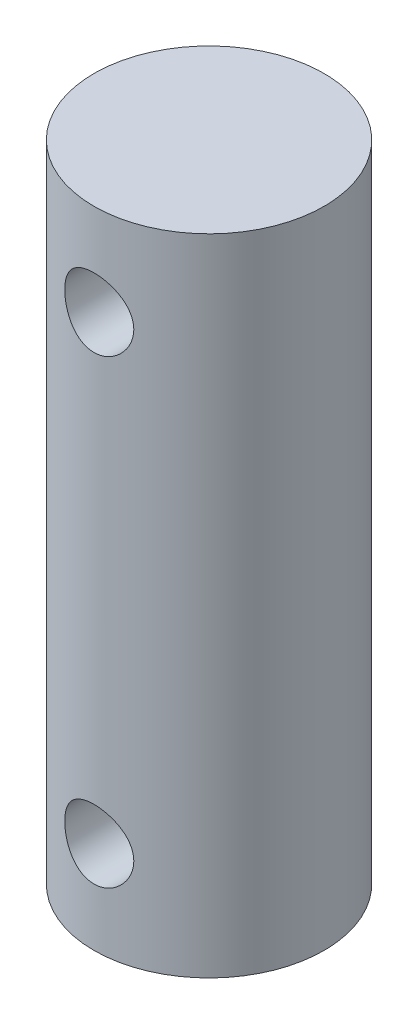
ISO-10303-21;
HEADER;
FILE_DESCRIPTION(('STEP AP214'),'2;1');
FILE_NAME('part.step','',(''),(''),'','','');
FILE_SCHEMA(('AUTOMOTIVE_DESIGN { 1 0 10303 214 1 1 1 1 }'));
ENDSEC;
DATA;
#1=APPLICATION_CONTEXT('core data for automotive mechanical design processes');
#2=APPLICATION_PROTOCOL_DEFINITION('international standard','automotive_design',2000,#1);
#3=PRODUCT_CONTEXT('',#1,'mechanical');
#4=PRODUCT('Part','Part','',(#3));
#5=PRODUCT_RELATED_PRODUCT_CATEGORY('part','',(#4));
#6=PRODUCT_DEFINITION_FORMATION('','',#4);
#7=PRODUCT_DEFINITION_CONTEXT('part definition',#1,'design');
#8=PRODUCT_DEFINITION('design','',#6,#7);
#9=PRODUCT_DEFINITION_SHAPE('','',#8);
#10=(LENGTH_UNIT() NAMED_UNIT(*) SI_UNIT(.MILLI.,.METRE.));
#11=(NAMED_UNIT(*) PLANE_ANGLE_UNIT() SI_UNIT($,.RADIAN.));
#12=(NAMED_UNIT(*) SI_UNIT($,.STERADIAN.) SOLID_ANGLE_UNIT());
#13=UNCERTAINTY_MEASURE_WITH_UNIT(LENGTH_MEASURE(1.E-05),#10,'distance_accuracy_value','');
#14=(GEOMETRIC_REPRESENTATION_CONTEXT(3) GLOBAL_UNCERTAINTY_ASSIGNED_CONTEXT((#13)) GLOBAL_UNIT_ASSIGNED_CONTEXT((#10,
#11,#12)) REPRESENTATION_CONTEXT('',''));
#15=CARTESIAN_POINT('',(0.,0.,0.));
#16=DIRECTION('',(0.,0.,1.));
#17=DIRECTION('',(1.,0.,0.));
#18=AXIS2_PLACEMENT_3D('',#15,#16,#17);
#19=CARTESIAN_POINT('',(0.,28.,0.));
#20=DIRECTION('',(0.,-1.,0.));
#21=DIRECTION('',(0.,0.,-1.));
#22=AXIS2_PLACEMENT_3D('',#19,#20,#21);
#23=CYLINDRICAL_SURFACE('',#22,4.9995);
#24=CARTESIAN_POINT('',(0.,5.5,-4.9995));
#25=CARTESIAN_POINT('',(-0.0822882318103573,5.49999900355128,-4.99949929315162));
#26=CARTESIAN_POINT('',(-0.164586545970862,5.49320619957434,-4.99744897138968));
#27=CARTESIAN_POINT('',(-0.326786557363017,5.4662789711516,-4.98947014707372));
#28=CARTESIAN_POINT('',(-0.40668753276012,5.4461405696831,-4.983540488474));
#29=CARTESIAN_POINT('',(-0.56172992899045,5.39325507558644,-4.96845270977354));
#30=CARTESIAN_POINT('',(-0.636878183004616,5.3605265872726,-4.95929935499205));
#31=CARTESIAN_POINT('',(-0.780620261284363,5.28346625714133,-4.9387155552233));
#32=CARTESIAN_POINT('',(-0.849213211567997,5.23913287104579,-4.92728480722892));
#33=CARTESIAN_POINT('',(-0.979867289964808,5.13877985499191,-4.90299843582714));
#34=CARTESIAN_POINT('',(-1.04171361277387,5.08248764616569,-4.89011360755218));
#35=CARTESIAN_POINT('',(-1.15524494911831,4.96039587422278,-4.86454548849677));
#36=CARTESIAN_POINT('',(-1.20692825236866,4.89459471411793,-4.85186223196738));
#37=CARTESIAN_POINT('',(-1.29979693147417,4.7535352145765,-4.82782429744026));
#38=CARTESIAN_POINT('',(-1.34072010192775,4.67809748284461,-4.81650590927061));
#39=CARTESIAN_POINT('',(-1.40921184417178,4.52101647920492,-4.79691571360438));
#40=CARTESIAN_POINT('',(-1.4367836236066,4.43937470326456,-4.78864317446338));
#41=CARTESIAN_POINT('',(-1.47701531781306,4.27461518498199,-4.77638567207312));
#42=CARTESIAN_POINT('',(-1.49007124433276,4.19160282020392,-4.77228711495926));
#43=CARTESIAN_POINT('',(-1.50213720984132,4.02447255669556,-4.76850370996817));
#44=CARTESIAN_POINT('',(-1.50115065277686,3.94035493082357,-4.76881779245157));
#45=CARTESIAN_POINT('',(-1.48547070443912,3.77662255107472,-4.77372350462486));
#46=CARTESIAN_POINT('',(-1.471273478402,3.69695487361318,-4.77816028593543));
#47=CARTESIAN_POINT('',(-1.43037684741301,3.54118858669451,-4.79056096619536));
#48=CARTESIAN_POINT('',(-1.40367620839198,3.46509033035001,-4.79852521329638));
#49=CARTESIAN_POINT('',(-1.33816524801101,3.31740949320808,-4.81720702437389));
#50=CARTESIAN_POINT('',(-1.29919401875796,3.24590306972879,-4.82796081770019));
#51=CARTESIAN_POINT('',(-1.2103599689013,3.11027857515019,-4.85099262684589));
#52=CARTESIAN_POINT('',(-1.16049450829025,3.04616230067435,-4.86327101180889));
#53=CARTESIAN_POINT('',(-1.04882339032887,2.92432403429443,-4.88859651842636));
#54=CARTESIAN_POINT('',(-0.986605995005051,2.86698099412054,-4.9016543277808));
#55=CARTESIAN_POINT('',(-0.853275435172072,2.76345442079052,-4.92661293163904));
#56=CARTESIAN_POINT('',(-0.782161710943637,2.71727159032387,-4.93851365325999));
#57=CARTESIAN_POINT('',(-0.632368302047808,2.63714621889189,-4.95992592037121));
#58=CARTESIAN_POINT('',(-0.5536411159832,2.60328776443068,-4.96942092348073));
#59=CARTESIAN_POINT('',(-0.391258759312093,2.54940399296898,-4.98483270164697));
#60=CARTESIAN_POINT('',(-0.307604970593451,2.52937481679157,-4.99075047490246));
#61=CARTESIAN_POINT('',(-0.140965580610644,2.50434909209977,-4.99818313348702));
#62=CARTESIAN_POINT('',(-0.0580637009655074,2.49883895173836,-4.99984837786376));
#63=CARTESIAN_POINT('',(0.107485605687788,2.50156816324412,-4.99902948297921));
#64=CARTESIAN_POINT('',(0.190133065194841,2.50980567924013,-4.99654589775536));
#65=CARTESIAN_POINT('',(0.350888890695829,2.5393811122736,-4.98780682505987));
#66=CARTESIAN_POINT('',(0.429057617811551,2.56041890987762,-4.98163780582543));
#67=CARTESIAN_POINT('',(0.580738763479281,2.61463661829694,-4.96624198187106));
#68=CARTESIAN_POINT('',(0.654250621044984,2.64781798872808,-4.95701480958421));
#69=CARTESIAN_POINT('',(0.796420887713407,2.72624300644525,-4.93619276376727));
#70=CARTESIAN_POINT('',(0.864927643717733,2.77174798416267,-4.92454804671716));
#71=CARTESIAN_POINT('',(0.99350758968355,2.87321093660342,-4.90022775161275));
#72=CARTESIAN_POINT('',(1.05357865861876,2.92917153202075,-4.88755191555985));
#73=CARTESIAN_POINT('',(1.16584348220005,3.05237012893718,-4.8620209445252));
#74=CARTESIAN_POINT('',(1.21767184545333,3.11994393236998,-4.84917602136773));
#75=CARTESIAN_POINT('',(1.30927911246089,3.26310867937917,-4.82525005243495));
#76=CARTESIAN_POINT('',(1.34905833192434,3.33869941282753,-4.81416896044772));
#77=CARTESIAN_POINT('',(1.41516617346623,3.49551198327512,-4.79515275536377));
#78=CARTESIAN_POINT('',(1.44155742571908,3.57670554307463,-4.78720303323697));
#79=CARTESIAN_POINT('',(1.48021373978481,3.74266734895499,-4.77539359377254));
#80=CARTESIAN_POINT('',(1.49248364379634,3.82743435936089,-4.7715324744927));
#81=CARTESIAN_POINT('',(1.50221974644656,3.99434088758499,-4.7684755356289));
#82=CARTESIAN_POINT('',(1.50028160170085,4.0764426750478,-4.76909198856055));
#83=CARTESIAN_POINT('',(1.48307849610884,4.23909262703719,-4.77446937826065));
#84=CARTESIAN_POINT('',(1.46781406912806,4.31964085366899,-4.77923014900316));
#85=CARTESIAN_POINT('',(1.42477624510824,4.47592323822191,-4.79223382092982));
#86=CARTESIAN_POINT('',(1.39716059728869,4.55170476903807,-4.80043273040666));
#87=CARTESIAN_POINT('',(1.33032706935654,4.69761946007976,-4.81938078291697));
#88=CARTESIAN_POINT('',(1.29110696824275,4.76775153577192,-4.83013041406046));
#89=CARTESIAN_POINT('',(1.20050456626341,4.90314057456883,-4.8534575220303));
#90=CARTESIAN_POINT('',(1.14873121319029,4.9681268253782,-4.86608732477694));
#91=CARTESIAN_POINT('',(1.03519580182295,5.08868206078478,-4.89149761158301));
#92=CARTESIAN_POINT('',(0.973431151683982,5.14424859413032,-4.90427813394096));
#93=CARTESIAN_POINT('',(0.839491038765239,5.24600639262439,-4.92899790098713));
#94=CARTESIAN_POINT('',(0.767063952529331,5.29187598208842,-4.94090161528917));
#95=CARTESIAN_POINT('',(0.615168669176429,5.37072293361679,-4.96209964680524));
#96=CARTESIAN_POINT('',(0.535703785423947,5.40370632328437,-4.97139518343641));
#97=CARTESIAN_POINT('',(0.380781543013545,5.45288928376781,-4.98551858988817));
#98=CARTESIAN_POINT('',(0.305806267514486,5.47050791493911,-4.99071828405647));
#99=CARTESIAN_POINT('',(0.153890046268792,5.49406276221235,-4.99770903461827));
#100=CARTESIAN_POINT('',(0.0769494313938691,5.50000093179986,-4.99950066098857));
#101=CARTESIAN_POINT('',(0.,5.5,-4.9995));
#102=B_SPLINE_CURVE_WITH_KNOTS('',3,(#24,#25,#26,#27,#28,#29,#30,#31,#32,#33,#34,#35,#36,#37,
#38,#39,#40,#41,#42,#43,#44,#45,#46,#47,#48,#49,#50,#51,#52,#53,#54,#55,#56,#57,#58,#59,#60,#61,
#62,#63,#64,#65,#66,#67,#68,#69,#70,#71,#72,#73,#74,#75,#76,#77,#78,#79,#80,#81,#82,#83,#84,#85,
#86,#87,#88,#89,#90,#91,#92,#93,#94,#95,#96,#97,#98,#99,#100,#101),.UNSPECIFIED.,.T.,.F.,(4,2,2,
2,2,2,2,2,2,2,2,2,2,2,2,2,2,2,2,2,2,2,2,2,2,2,2,2,2,2,2,2,2,2,2,2,2,2,4),(0.,0.246582042262957,
0.493237599678211,0.739530066768359,0.985855324978032,1.23855108126446,1.49128932616337,
1.74971097603988,2.00807050980335,2.25919412483039,2.51025686765982,2.75225510058685,
2.99427722343271,3.23961540433148,3.48501310429571,3.74066099880916,3.99632498570029,
4.25370198924409,4.51100714050092,4.75908006530313,5.00711986493279,5.24955685599718,
5.49202299673263,5.74009926563503,5.98823779831807,6.24538963558794,6.50253473443576,
6.75846552682358,7.01430853458267,7.25948886482311,7.50465937332059,7.74678423300267,
7.98895546348937,8.23994987755645,8.49100950686656,8.74941080980363,9.00769109873345,
9.23831365156655,9.46889763091128),.UNSPECIFIED.);
#103=CARTESIAN_POINT('',(0.,5.5,-4.9995));
#104=VERTEX_POINT('',#103);
#105=EDGE_CURVE('E10',#104,#104,#102,.T.);
#106=ORIENTED_EDGE('',*,*,#105,.T.);
#107=EDGE_LOOP('',(#106));
#108=FACE_BOUND('',#107,.T.);
#109=CARTESIAN_POINT('',(1.5,4.,4.76917186207417));
#110=CARTESIAN_POINT('',(1.4999989773865,3.91780587028772,4.76917271152598));
#111=CARTESIAN_POINT('',(1.49322115073131,3.83560162284736,4.77131997127978));
#112=CARTESIAN_POINT('',(1.46635880104802,3.6735964700626,4.77964267680911));
#113=CARTESIAN_POINT('',(1.44626983391528,3.59379637668323,4.78581946788764));
#114=CARTESIAN_POINT('',(1.39352873190079,3.43896832690937,4.80144005343739));
#115=CARTESIAN_POINT('',(1.36089749539186,3.36393267289101,4.81087841074486));
#116=CARTESIAN_POINT('',(1.28406680345577,3.22038238376294,4.83195130138834));
#117=CARTESIAN_POINT('',(1.23986561550101,3.15186872737851,4.84358616356437));
#118=CARTESIAN_POINT('',(1.13965174522201,3.02113851891203,4.868154148176));
#119=CARTESIAN_POINT('',(1.08333667754419,2.95915891109228,4.88111493380339));
#120=CARTESIAN_POINT('',(0.961141637576105,2.84536655722006,4.90663809832714));
#121=CARTESIAN_POINT('',(0.895260437444336,2.79355511829281,4.91920042582763));
#122=CARTESIAN_POINT('',(0.754117636492482,2.70054088336181,4.94282547018896));
#123=CARTESIAN_POINT('',(0.678690196697473,2.6595796840159,4.95385179441378));
#124=CARTESIAN_POINT('',(0.521630610557552,2.59101493272329,4.97284105698035));
#125=CARTESIAN_POINT('',(0.439999807058355,2.5634084993394,4.98080465606254));
#126=CARTESIAN_POINT('',(0.275329569800371,2.52312107180541,4.99257544897168));
#127=CARTESIAN_POINT('',(0.192397264947573,2.51003563440731,4.99649504552013));
#128=CARTESIAN_POINT('',(0.0254279114737982,2.49788278350668,5.00013204540282));
#129=CARTESIAN_POINT('',(-0.0586089013571464,2.49881242511744,4.999850331528));
#130=CARTESIAN_POINT('',(-0.22256436561369,2.51439188428554,4.9951959007767));
#131=CARTESIAN_POINT('',(-0.302528927045674,2.52860371987104,4.99095378342565));
#132=CARTESIAN_POINT('',(-0.458880850931006,2.56962868946834,4.97901392721447));
#133=CARTESIAN_POINT('',(-0.535267986492155,2.59644262155988,4.97131596950038));
#134=CARTESIAN_POINT('',(-0.683337766225032,2.66220717562238,4.95314884686625));
#135=CARTESIAN_POINT('',(-0.754955244748188,2.70129553456882,4.9426484458174));
#136=CARTESIAN_POINT('',(-0.890754493682192,2.79039039848261,4.91999016973298));
#137=CARTESIAN_POINT('',(-0.954934494191413,2.84039949413159,4.9078319016659));
#138=CARTESIAN_POINT('',(-1.07665066277613,2.95218767015931,4.8826057096019));
#139=CARTESIAN_POINT('',(-1.13383526419769,3.014346211813,4.86952078696669));
#140=CARTESIAN_POINT('',(-1.23706833186632,3.14749815324586,4.84432588364868));
#141=CARTESIAN_POINT('',(-1.28311569096999,3.21849243031605,4.8322159999734));
#142=CARTESIAN_POINT('',(-1.36313392919628,3.36822644017448,4.81026108079922));
#143=CARTESIAN_POINT('',(-1.39698472404716,3.44703394037749,4.8004388858425));
#144=CARTESIAN_POINT('',(-1.45083014142943,3.60959418408034,4.78444251727054));
#145=CARTESIAN_POINT('',(-1.47082928527232,3.69334530423941,4.7782671533918));
#146=CARTESIAN_POINT('',(-1.49574647856022,3.86006941306297,4.77052488504463));
#147=CARTESIAN_POINT('',(-1.50119895068651,3.9429550156055,4.76879476147216));
#148=CARTESIAN_POINT('',(-1.4983604450702,4.10845930039935,4.76968753033572));
#149=CARTESIAN_POINT('',(-1.49007139161365,4.19107801840045,4.77230981328525));
#150=CARTESIAN_POINT('',(-1.46046106912417,4.35147393406097,4.78145173537775));
#151=CARTESIAN_POINT('',(-1.43948404519667,4.42932115304315,4.78786832928977));
#152=CARTESIAN_POINT('',(-1.38549242300728,4.58038571278288,4.80376912010561));
#153=CARTESIAN_POINT('',(-1.35247596587849,4.65360233653529,4.81325379068943));
#154=CARTESIAN_POINT('',(-1.27432906911965,4.79550081578454,4.83453855398191));
#155=CARTESIAN_POINT('',(-1.22889723177361,4.86400817869626,4.84639396751169));
#156=CARTESIAN_POINT('',(-1.12756713654274,4.99262201665442,4.87096558532055));
#157=CARTESIAN_POINT('',(-1.07166637299806,5.05272647450049,4.88368199520656));
#158=CARTESIAN_POINT('',(-0.948472661932269,5.16516614087998,4.90912373834617));
#159=CARTESIAN_POINT('',(-0.880829328033722,5.21712241877292,4.92183128763823));
#160=CARTESIAN_POINT('',(-0.73748127867682,5.30895572340917,4.94534012984108));
#161=CARTESIAN_POINT('',(-0.661776963755019,5.34883334994211,4.95614151739504));
#162=CARTESIAN_POINT('',(-0.504956178885123,5.41499266325002,4.97455509654605));
#163=CARTESIAN_POINT('',(-0.423885477857306,5.44137589778601,4.98219102369165));
#164=CARTESIAN_POINT('',(-0.258190901115053,5.48005728063301,4.99351811501093));
#165=CARTESIAN_POINT('',(-0.173568049423719,5.4923594597482,4.99721040805823));
#166=CARTESIAN_POINT('',(-0.00667317781315463,5.50222293196314,5.00016547277616));
#167=CARTESIAN_POINT('',(0.0755638451776266,5.50033375172961,4.99959337947921));
#168=CARTESIAN_POINT('',(0.238497723158008,5.48318184759017,4.99447317680887));
#169=CARTESIAN_POINT('',(0.319194665239234,5.46791988221911,4.98992529295142));
#170=CARTESIAN_POINT('',(0.475913577312359,5.42479572708574,4.97741158587844));
#171=CARTESIAN_POINT('',(0.551976455400884,5.39707065534838,4.9694830043992));
#172=CARTESIAN_POINT('',(0.698410533316663,5.32992996426894,4.9510277375725));
#173=CARTESIAN_POINT('',(0.768780795285054,5.29051242356385,4.94050062526967));
#174=CARTESIAN_POINT('',(0.904279803379401,5.19964316259136,4.91753539548962));
#175=CARTESIAN_POINT('',(0.969168742790657,5.14784669353774,4.90504690319008));
#176=CARTESIAN_POINT('',(1.08951750442839,5.03431071072321,4.8797275929332));
#177=CARTESIAN_POINT('',(1.14497460113189,4.97256833289163,4.86689667726067));
#178=CARTESIAN_POINT('',(1.24654593036395,4.8386841490717,4.84189486730984));
#179=CARTESIAN_POINT('',(1.29233234364137,4.76628718814074,4.82975505335877));
#180=CARTESIAN_POINT('',(1.37103103066297,4.61447185785981,4.80800903100014));
#181=CARTESIAN_POINT('',(1.40394948830736,4.53505688368034,4.79840160633751));
#182=CARTESIAN_POINT('',(1.45301347988047,4.38028324474243,4.78375744225404));
#183=CARTESIAN_POINT('',(1.47058486074054,4.30541053766636,4.77833956062943));
#184=CARTESIAN_POINT('',(1.49407743051818,4.15369456988368,4.7710467287259));
#185=CARTESIAN_POINT('',(1.50000095614607,4.07685170754985,4.7691710678347));
#186=CARTESIAN_POINT('',(1.5,4.,4.76917186207417));
#187=B_SPLINE_CURVE_WITH_KNOTS('',3,(#109,#110,#111,#112,#113,#114,#115,#116,#117,#118,#119,
#120,#121,#122,#123,#124,#125,#126,#127,#128,#129,#130,#131,#132,#133,#134,#135,#136,#137,#138,
#139,#140,#141,#142,#143,#144,#145,#146,#147,#148,#149,#150,#151,#152,#153,#154,#155,#156,#157,
#158,#159,#160,#161,#162,#163,#164,#165,#166,#167,#168,#169,#170,#171,#172,#173,#174,#175,#176,
#177,#178,#179,#180,#181,#182,#183,#184,#185,#186),.UNSPECIFIED.,.T.,.F.,(4,2,2,2,2,2,2,2,2,2,2,
2,2,2,2,2,2,2,2,2,2,2,2,2,2,2,2,2,2,2,2,2,2,2,2,2,2,2,4),(0.,0.246298892274777,
0.492680056233152,0.738652458486959,0.98466171465581,1.2377262257928,1.4908232472708,
1.74915534958728,2.00743168903299,2.2583182937458,2.50915218221458,2.7519960771557,
2.99485535326059,3.24054359801017,3.4862901898129,3.74151177235864,3.99675871583791,
4.25445418536574,4.51206550093421,4.76007317546142,5.00804612332057,5.24957538274814,
5.49114194966112,5.73919316780124,5.98730383121201,6.24478044778547,6.50224427674477,
6.75774103402629,7.01316463520365,7.25875003049568,7.50432149652629,7.74725493266761,
7.99022831094049,8.24097731251366,8.49179865045393,8.75009751364508,9.00827209416855,
9.23860835972345,9.46889841213003),.UNSPECIFIED.);
#188=CARTESIAN_POINT('',(1.5,4.,4.76917186207417));
#189=VERTEX_POINT('',#188);
#190=EDGE_CURVE('E51',#189,#189,#187,.T.);
#191=ORIENTED_EDGE('',*,*,#190,.T.);
#192=EDGE_LOOP('',(#191));
#193=FACE_BOUND('',#192,.T.);
#194=CARTESIAN_POINT('',(0.,25.5,-4.9995));
#195=CARTESIAN_POINT('',(-0.0822882318103571,25.4999990035513,-4.99949929315162));
#196=CARTESIAN_POINT('',(-0.164586545970862,25.4932061995743,-4.99744897138968));
#197=CARTESIAN_POINT('',(-0.326786557363017,25.4662789711516,-4.98947014707372));
#198=CARTESIAN_POINT('',(-0.40668753276012,25.4461405696831,-4.983540488474));
#199=CARTESIAN_POINT('',(-0.56172992899045,25.3932550755864,-4.96845270977354));
#200=CARTESIAN_POINT('',(-0.636878183004615,25.3605265872726,-4.95929935499205));
#201=CARTESIAN_POINT('',(-0.780620261284362,25.2834662571413,-4.9387155552233));
#202=CARTESIAN_POINT('',(-0.849213211567997,25.2391328710458,-4.92728480722892));
#203=CARTESIAN_POINT('',(-0.979867289964808,25.1387798549919,-4.90299843582714));
#204=CARTESIAN_POINT('',(-1.04171361277387,25.0824876461657,-4.89011360755218));
#205=CARTESIAN_POINT('',(-1.1552449491183,24.9603958742228,-4.86454548849677));
#206=CARTESIAN_POINT('',(-1.20692825236866,24.8945947141179,-4.85186223196738));
#207=CARTESIAN_POINT('',(-1.29979693147417,24.7535352145765,-4.82782429744026));
#208=CARTESIAN_POINT('',(-1.34072010192775,24.6780974828446,-4.81650590927061));
#209=CARTESIAN_POINT('',(-1.40921184417178,24.5210164792049,-4.79691571360438));
#210=CARTESIAN_POINT('',(-1.4367836236066,24.4393747032646,-4.78864317446338));
#211=CARTESIAN_POINT('',(-1.47701531781306,24.274615184982,-4.77638567207312));
#212=CARTESIAN_POINT('',(-1.49007124433276,24.1916028202039,-4.77228711495926));
#213=CARTESIAN_POINT('',(-1.50213720984132,24.0244725566956,-4.76850370996817));
#214=CARTESIAN_POINT('',(-1.50115065277686,23.9403549308236,-4.76881779245157));
#215=CARTESIAN_POINT('',(-1.48547070443912,23.7766225510747,-4.77372350462486));
#216=CARTESIAN_POINT('',(-1.471273478402,23.6969548736132,-4.77816028593543));
#217=CARTESIAN_POINT('',(-1.43037684741301,23.5411885866945,-4.79056096619536));
#218=CARTESIAN_POINT('',(-1.40367620839198,23.46509033035,-4.79852521329638));
#219=CARTESIAN_POINT('',(-1.338165248011,23.3174094932081,-4.81720702437389));
#220=CARTESIAN_POINT('',(-1.29919401875796,23.2459030697288,-4.82796081770019));
#221=CARTESIAN_POINT('',(-1.2103599689013,23.1102785751502,-4.85099262684589));
#222=CARTESIAN_POINT('',(-1.16049450829025,23.0461623006744,-4.86327101180889));
#223=CARTESIAN_POINT('',(-1.04882339032887,22.9243240342944,-4.88859651842636));
#224=CARTESIAN_POINT('',(-0.98660599500505,22.8669809941205,-4.9016543277808));
#225=CARTESIAN_POINT('',(-0.853275435172069,22.7634544207905,-4.92661293163904));
#226=CARTESIAN_POINT('',(-0.782161710943634,22.7172715903239,-4.93851365325999));
#227=CARTESIAN_POINT('',(-0.632368302047806,22.6371462188919,-4.95992592037121));
#228=CARTESIAN_POINT('',(-0.5536411159832,22.6032877644307,-4.96942092348073));
#229=CARTESIAN_POINT('',(-0.391258759312093,22.549403992969,-4.98483270164697));
#230=CARTESIAN_POINT('',(-0.307604970593451,22.5293748167916,-4.99075047490246));
#231=CARTESIAN_POINT('',(-0.140965580610644,22.5043490920998,-4.99818313348702));
#232=CARTESIAN_POINT('',(-0.0580637009655076,22.4988389517384,-4.99984837786376));
#233=CARTESIAN_POINT('',(0.107485605687788,22.5015681632441,-4.99902948297921));
#234=CARTESIAN_POINT('',(0.190133065194841,22.5098056792401,-4.99654589775536));
#235=CARTESIAN_POINT('',(0.350888890695829,22.5393811122736,-4.98780682505987));
#236=CARTESIAN_POINT('',(0.429057617811551,22.5604189098776,-4.98163780582543));
#237=CARTESIAN_POINT('',(0.580738763479282,22.6146366182969,-4.96624198187106));
#238=CARTESIAN_POINT('',(0.654250621044984,22.6478179887281,-4.95701480958421));
#239=CARTESIAN_POINT('',(0.796420887713408,22.7262430064452,-4.93619276376727));
#240=CARTESIAN_POINT('',(0.864927643717733,22.7717479841627,-4.92454804671716));
#241=CARTESIAN_POINT('',(0.99350758968355,22.8732109366034,-4.90022775161275));
#242=CARTESIAN_POINT('',(1.05357865861876,22.9291715320207,-4.88755191555985));
#243=CARTESIAN_POINT('',(1.16584348220005,23.0523701289372,-4.8620209445252));
#244=CARTESIAN_POINT('',(1.21767184545333,23.11994393237,-4.84917602136773));
#245=CARTESIAN_POINT('',(1.30927911246089,23.2631086793792,-4.82525005243495));
#246=CARTESIAN_POINT('',(1.34905833192434,23.3386994128275,-4.81416896044772));
#247=CARTESIAN_POINT('',(1.41516617346623,23.4955119832751,-4.79515275536377));
#248=CARTESIAN_POINT('',(1.44155742571908,23.5767055430746,-4.78720303323697));
#249=CARTESIAN_POINT('',(1.48021373978481,23.742667348955,-4.77539359377254));
#250=CARTESIAN_POINT('',(1.49248364379634,23.8274343593609,-4.7715324744927));
#251=CARTESIAN_POINT('',(1.50221974644656,23.994340887585,-4.7684755356289));
#252=CARTESIAN_POINT('',(1.50028160170085,24.0764426750478,-4.76909198856055));
#253=CARTESIAN_POINT('',(1.48307849610884,24.2390926270372,-4.77446937826065));
#254=CARTESIAN_POINT('',(1.46781406912806,24.319640853669,-4.77923014900316));
#255=CARTESIAN_POINT('',(1.42477624510824,24.4759232382219,-4.79223382092983));
#256=CARTESIAN_POINT('',(1.39716059728869,24.5517047690381,-4.80043273040666));
#257=CARTESIAN_POINT('',(1.33032706935653,24.6976194600798,-4.81938078291697));
#258=CARTESIAN_POINT('',(1.29110696824275,24.7677515357719,-4.83013041406046));
#259=CARTESIAN_POINT('',(1.20050456626341,24.9031405745688,-4.8534575220303));
#260=CARTESIAN_POINT('',(1.14873121319028,24.9681268253782,-4.86608732477694));
#261=CARTESIAN_POINT('',(1.03519580182295,25.0886820607848,-4.89149761158301));
#262=CARTESIAN_POINT('',(0.973431151683982,25.1442485941303,-4.90427813394096));
#263=CARTESIAN_POINT('',(0.839491038765239,25.2460063926244,-4.92899790098712));
#264=CARTESIAN_POINT('',(0.76706395252933,25.2918759820884,-4.94090161528917));
#265=CARTESIAN_POINT('',(0.615168669176427,25.3707229336168,-4.96209964680524));
#266=CARTESIAN_POINT('',(0.535703785423946,25.4037063232844,-4.97139518343641));
#267=CARTESIAN_POINT('',(0.380781543013544,25.4528892837678,-4.98551858988817));
#268=CARTESIAN_POINT('',(0.305806267514484,25.4705079149391,-4.99071828405647));
#269=CARTESIAN_POINT('',(0.153890046268791,25.4940627622123,-4.99770903461827));
#270=CARTESIAN_POINT('',(0.0769494313938684,25.5000009317999,-4.99950066098857));
#271=CARTESIAN_POINT('',(0.,25.5,-4.9995));
#272=B_SPLINE_CURVE_WITH_KNOTS('',3,(#194,#195,#196,#197,#198,#199,#200,#201,#202,#203,#204,
#205,#206,#207,#208,#209,#210,#211,#212,#213,#214,#215,#216,#217,#218,#219,#220,#221,#222,#223,
#224,#225,#226,#227,#228,#229,#230,#231,#232,#233,#234,#235,#236,#237,#238,#239,#240,#241,#242,
#243,#244,#245,#246,#247,#248,#249,#250,#251,#252,#253,#254,#255,#256,#257,#258,#259,#260,#261,
#262,#263,#264,#265,#266,#267,#268,#269,#270,#271),.UNSPECIFIED.,.T.,.F.,(4,2,2,2,2,2,2,2,2,2,2,
2,2,2,2,2,2,2,2,2,2,2,2,2,2,2,2,2,2,2,2,2,2,2,2,2,2,2,4),(0.,0.246582042262957,
0.493237599678212,0.739530066768359,0.985855324978032,1.23855108126446,1.49128932616337,
1.74971097603988,2.00807050980335,2.25919412483039,2.51025686765981,2.75225510058685,
2.99427722343271,3.23961540433148,3.48501310429572,3.74066099880917,3.99632498570029,
4.25370198924409,4.51100714050092,4.75908006530313,5.00711986493279,5.24955685599718,
5.49202299673263,5.74009926563503,5.98823779831807,6.24538963558794,6.50253473443576,
6.75846552682358,7.01430853458267,7.25948886482311,7.50465937332059,7.74678423300266,
7.98895546348937,8.23994987755644,8.49100950686656,8.74941080980363,9.00769109873345,
9.23831365156655,9.46889763091127),.UNSPECIFIED.);
#273=CARTESIAN_POINT('',(0.,25.5,-4.9995));
#274=VERTEX_POINT('',#273);
#275=EDGE_CURVE('E56',#274,#274,#272,.T.);
#276=ORIENTED_EDGE('',*,*,#275,.T.);
#277=EDGE_LOOP('',(#276));
#278=FACE_BOUND('',#277,.T.);
#279=CARTESIAN_POINT('',(1.5,24.,4.76917186207417));
#280=CARTESIAN_POINT('',(1.4999989773865,23.9178058702877,4.76917271152598));
#281=CARTESIAN_POINT('',(1.49322115073131,23.8356016228474,4.77131997127978));
#282=CARTESIAN_POINT('',(1.46635880104802,23.6735964700626,4.77964267680911));
#283=CARTESIAN_POINT('',(1.44626983391528,23.5937963766832,4.78581946788764));
#284=CARTESIAN_POINT('',(1.39352873190079,23.4389683269094,4.80144005343739));
#285=CARTESIAN_POINT('',(1.36089749539186,23.363932672891,4.81087841074486));
#286=CARTESIAN_POINT('',(1.28406680345577,23.2203823837629,4.83195130138834));
#287=CARTESIAN_POINT('',(1.23986561550101,23.1518687273785,4.84358616356437));
#288=CARTESIAN_POINT('',(1.13965174522201,23.021138518912,4.868154148176));
#289=CARTESIAN_POINT('',(1.08333667754419,22.9591589110923,4.88111493380339));
#290=CARTESIAN_POINT('',(0.961141637576108,22.8453665572201,4.90663809832714));
#291=CARTESIAN_POINT('',(0.895260437444337,22.7935551182928,4.91920042582763));
#292=CARTESIAN_POINT('',(0.754117636492483,22.7005408833618,4.94282547018896));
#293=CARTESIAN_POINT('',(0.678690196697474,22.6595796840159,4.95385179441378));
#294=CARTESIAN_POINT('',(0.521630610557555,22.5910149327233,4.97284105698035));
#295=CARTESIAN_POINT('',(0.439999807058356,22.5634084993394,4.98080465606254));
#296=CARTESIAN_POINT('',(0.275329569800373,22.5231210718054,4.99257544897168));
#297=CARTESIAN_POINT('',(0.192397264947575,22.5100356344073,4.99649504552013));
#298=CARTESIAN_POINT('',(0.0254279114737997,22.4978827835067,5.00013204540282));
#299=CARTESIAN_POINT('',(-0.0586089013571449,22.4988124251174,4.999850331528));
#300=CARTESIAN_POINT('',(-0.222564365613689,22.5143918842855,4.9951959007767));
#301=CARTESIAN_POINT('',(-0.302528927045673,22.528603719871,4.99095378342565));
#302=CARTESIAN_POINT('',(-0.458880850931005,22.5696286894683,4.97901392721447));
#303=CARTESIAN_POINT('',(-0.535267986492153,22.5964426215599,4.97131596950038));
#304=CARTESIAN_POINT('',(-0.683337766225031,22.6622071756224,4.95314884686625));
#305=CARTESIAN_POINT('',(-0.754955244748187,22.7012955345688,4.9426484458174));
#306=CARTESIAN_POINT('',(-0.890754493682191,22.7903903984826,4.91999016973298));
#307=CARTESIAN_POINT('',(-0.954934494191412,22.8403994941316,4.9078319016659));
#308=CARTESIAN_POINT('',(-1.07665066277613,22.9521876701593,4.8826057096019));
#309=CARTESIAN_POINT('',(-1.13383526419769,23.014346211813,4.86952078696669));
#310=CARTESIAN_POINT('',(-1.23706833186632,23.1474981532459,4.84432588364868));
#311=CARTESIAN_POINT('',(-1.28311569096998,23.2184924303161,4.83221599997341));
#312=CARTESIAN_POINT('',(-1.36313392919628,23.3682264401745,4.81026108079922));
#313=CARTESIAN_POINT('',(-1.39698472404716,23.4470339403775,4.8004388858425));
#314=CARTESIAN_POINT('',(-1.45083014142943,23.6095941840803,4.78444251727054));
#315=CARTESIAN_POINT('',(-1.47082928527232,23.6933453042394,4.7782671533918));
#316=CARTESIAN_POINT('',(-1.49574647856022,23.860069413063,4.77052488504463));
#317=CARTESIAN_POINT('',(-1.5011989506865,23.9429550156055,4.76879476147216));
#318=CARTESIAN_POINT('',(-1.4983604450702,24.1084593003993,4.76968753033572));
#319=CARTESIAN_POINT('',(-1.49007139161365,24.1910780184005,4.77230981328525));
#320=CARTESIAN_POINT('',(-1.46046106912417,24.351473934061,4.78145173537775));
#321=CARTESIAN_POINT('',(-1.43948404519667,24.4293211530431,4.78786832928977));
#322=CARTESIAN_POINT('',(-1.38549242300728,24.5803857127829,4.80376912010561));
#323=CARTESIAN_POINT('',(-1.35247596587849,24.6536023365353,4.81325379068943));
#324=CARTESIAN_POINT('',(-1.27432906911965,24.7955008157845,4.83453855398191));
#325=CARTESIAN_POINT('',(-1.22889723177362,24.8640081786963,4.84639396751169));
#326=CARTESIAN_POINT('',(-1.12756713654275,24.9926220166544,4.87096558532055));
#327=CARTESIAN_POINT('',(-1.07166637299806,25.0527264745005,4.88368199520656));
#328=CARTESIAN_POINT('',(-0.94847266193227,25.16516614088,4.90912373834617));
#329=CARTESIAN_POINT('',(-0.880829328033724,25.2171224187729,4.92183128763823));
#330=CARTESIAN_POINT('',(-0.737481278676823,25.3089557234092,4.94534012984108));
#331=CARTESIAN_POINT('',(-0.661776963755022,25.3488333499421,4.95614151739504));
#332=CARTESIAN_POINT('',(-0.504956178885125,25.41499266325,4.97455509654605));
#333=CARTESIAN_POINT('',(-0.423885477857307,25.441375897786,4.98219102369165));
#334=CARTESIAN_POINT('',(-0.258190901115055,25.480057280633,4.99351811501093));
#335=CARTESIAN_POINT('',(-0.173568049423721,25.4923594597482,4.99721040805823));
#336=CARTESIAN_POINT('',(-0.00667317781315611,25.5022229319631,5.00016547277616));
#337=CARTESIAN_POINT('',(0.0755638451776251,25.5003337517296,4.99959337947921));
#338=CARTESIAN_POINT('',(0.238497723158006,25.4831818475902,4.99447317680887));
#339=CARTESIAN_POINT('',(0.319194665239232,25.4679198822191,4.98992529295142));
#340=CARTESIAN_POINT('',(0.475913577312358,25.4247957270857,4.97741158587844));
#341=CARTESIAN_POINT('',(0.551976455400883,25.3970706553484,4.9694830043992));
#342=CARTESIAN_POINT('',(0.698410533316662,25.3299299642689,4.9510277375725));
#343=CARTESIAN_POINT('',(0.768780795285053,25.2905124235639,4.94050062526967));
#344=CARTESIAN_POINT('',(0.904279803379399,25.1996431625914,4.91753539548962));
#345=CARTESIAN_POINT('',(0.969168742790657,25.1478466935377,4.90504690319008));
#346=CARTESIAN_POINT('',(1.08951750442839,25.0343107107232,4.8797275929332));
#347=CARTESIAN_POINT('',(1.14497460113189,24.9725683328916,4.86689667726067));
#348=CARTESIAN_POINT('',(1.24654593036395,24.8386841490717,4.84189486730984));
#349=CARTESIAN_POINT('',(1.29233234364137,24.7662871881407,4.82975505335877));
#350=CARTESIAN_POINT('',(1.37103103066297,24.6144718578598,4.80800903100014));
#351=CARTESIAN_POINT('',(1.40394948830736,24.5350568836803,4.79840160633751));
#352=CARTESIAN_POINT('',(1.45301347988047,24.3802832447424,4.78375744225404));
#353=CARTESIAN_POINT('',(1.47058486074054,24.3054105376664,4.77833956062943));
#354=CARTESIAN_POINT('',(1.49407743051818,24.1536945698837,4.7710467287259));
#355=CARTESIAN_POINT('',(1.50000095614607,24.0768517075498,4.7691710678347));
#356=CARTESIAN_POINT('',(1.5,24.,4.76917186207417));
#357=B_SPLINE_CURVE_WITH_KNOTS('',3,(#279,#280,#281,#282,#283,#284,#285,#286,#287,#288,#289,
#290,#291,#292,#293,#294,#295,#296,#297,#298,#299,#300,#301,#302,#303,#304,#305,#306,#307,#308,
#309,#310,#311,#312,#313,#314,#315,#316,#317,#318,#319,#320,#321,#322,#323,#324,#325,#326,#327,
#328,#329,#330,#331,#332,#333,#334,#335,#336,#337,#338,#339,#340,#341,#342,#343,#344,#345,#346,
#347,#348,#349,#350,#351,#352,#353,#354,#355,#356),.UNSPECIFIED.,.T.,.F.,(4,2,2,2,2,2,2,2,2,2,2,
2,2,2,2,2,2,2,2,2,2,2,2,2,2,2,2,2,2,2,2,2,2,2,2,2,2,2,4),(0.,0.246298892274777,0.49268005623315,
0.73865245848695,0.984661714655803,1.23772622579279,1.4908232472708,1.74915534958728,
2.00743168903298,2.2583182937458,2.50915218221458,2.7519960771557,2.99485535326058,
3.24054359801017,3.48629018981289,3.74151177235863,3.99675871583791,4.25445418536573,
4.5120655009342,4.76007317546141,5.00804612332057,5.24957538274814,5.49114194966112,
5.73919316780124,5.98730383121201,6.24478044778547,6.50224427674477,6.75774103402629,
7.01316463520364,7.25875003049567,7.50432149652629,7.74725493266761,7.99022831094049,
8.24097731251366,8.49179865045393,8.75009751364507,9.00827209416854,9.23860835972345,
9.46889841213003),.UNSPECIFIED.);
#358=CARTESIAN_POINT('',(1.5,24.,4.76917186207417));
#359=VERTEX_POINT('',#358);
#360=EDGE_CURVE('E61',#359,#359,#357,.T.);
#361=ORIENTED_EDGE('',*,*,#360,.T.);
#362=EDGE_LOOP('',(#361));
#363=FACE_BOUND('',#362,.T.);
#364=CARTESIAN_POINT('',(0.,28.,0.));
#365=DIRECTION('',(0.,1.,0.));
#366=DIRECTION('',(0.,0.,1.));
#367=AXIS2_PLACEMENT_3D('',#364,#365,#366);
#368=CIRCLE('',#367,4.9995);
#369=CARTESIAN_POINT('',(0.,28.,4.9995));
#370=VERTEX_POINT('',#369);
#371=EDGE_CURVE('E90',#370,#370,#368,.T.);
#372=ORIENTED_EDGE('',*,*,#371,.F.);
#373=EDGE_LOOP('',(#372));
#374=FACE_BOUND('',#373,.T.);
#375=CARTESIAN_POINT('',(0.,0.,0.));
#376=DIRECTION('',(0.,1.,0.));
#377=DIRECTION('',(0.,0.,1.));
#378=AXIS2_PLACEMENT_3D('',#375,#376,#377);
#379=CIRCLE('',#378,4.9995);
#380=CARTESIAN_POINT('',(0.,0.,4.9995));
#381=VERTEX_POINT('',#380);
#382=EDGE_CURVE('E91',#381,#381,#379,.T.);
#383=ORIENTED_EDGE('',*,*,#382,.T.);
#384=EDGE_LOOP('',(#383));
#385=FACE_BOUND('',#384,.T.);
#386=ADVANCED_FACE('F39',(#108,#193,#278,#363,#374,#385),#23,.T.);
#387=CARTESIAN_POINT('',(0.,28.,0.));
#388=DIRECTION('',(0.,1.,0.));
#389=DIRECTION('',(0.,0.,1.));
#390=AXIS2_PLACEMENT_3D('',#387,#388,#389);
#391=PLANE('',#390);
#392=ORIENTED_EDGE('',*,*,#371,.T.);
#393=EDGE_LOOP('',(#392));
#394=FACE_BOUND('',#393,.T.);
#395=ADVANCED_FACE('F82',(#394),#391,.T.);
#396=CARTESIAN_POINT('',(0.,0.,0.));
#397=DIRECTION('',(0.,1.,0.));
#398=DIRECTION('',(0.,0.,1.));
#399=AXIS2_PLACEMENT_3D('',#396,#397,#398);
#400=PLANE('',#399);
#401=ORIENTED_EDGE('',*,*,#382,.F.);
#402=EDGE_LOOP('',(#401));
#403=FACE_BOUND('',#402,.T.);
#404=ADVANCED_FACE('F80',(#403),#400,.F.);
#405=CARTESIAN_POINT('',(0.,24.,-4.9995));
#406=DIRECTION('',(0.,0.,1.));
#407=DIRECTION('',(1.,0.,0.));
#408=AXIS2_PLACEMENT_3D('',#405,#406,#407);
#409=CYLINDRICAL_SURFACE('',#408,1.5);
#410=ORIENTED_EDGE('',*,*,#360,.F.);
#411=EDGE_LOOP('',(#410));
#412=FACE_BOUND('',#411,.T.);
#413=ORIENTED_EDGE('',*,*,#275,.F.);
#414=EDGE_LOOP('',(#413));
#415=FACE_BOUND('',#414,.T.);
#416=ADVANCED_FACE('F74',(#412,#415),#409,.F.);
#417=CARTESIAN_POINT('',(0.,4.,-4.9995));
#418=DIRECTION('',(0.,0.,1.));
#419=DIRECTION('',(1.,0.,0.));
#420=AXIS2_PLACEMENT_3D('',#417,#418,#419);
#421=CYLINDRICAL_SURFACE('',#420,1.5);
#422=ORIENTED_EDGE('',*,*,#190,.F.);
#423=EDGE_LOOP('',(#422));
#424=FACE_BOUND('',#423,.T.);
#425=ORIENTED_EDGE('',*,*,#105,.F.);
#426=EDGE_LOOP('',(#425));
#427=FACE_BOUND('',#426,.T.);
#428=ADVANCED_FACE('F71',(#424,#427),#421,.F.);
#429=CLOSED_SHELL('',(#386,#395,#404,#416,#428));
#430=MANIFOLD_SOLID_BREP('B2',#429);
#431=ADVANCED_BREP_SHAPE_REPRESENTATION('',(#18,#430),#14);
#432=SHAPE_DEFINITION_REPRESENTATION(#9,#431);
ENDSEC;
END-ISO-10303-21;
